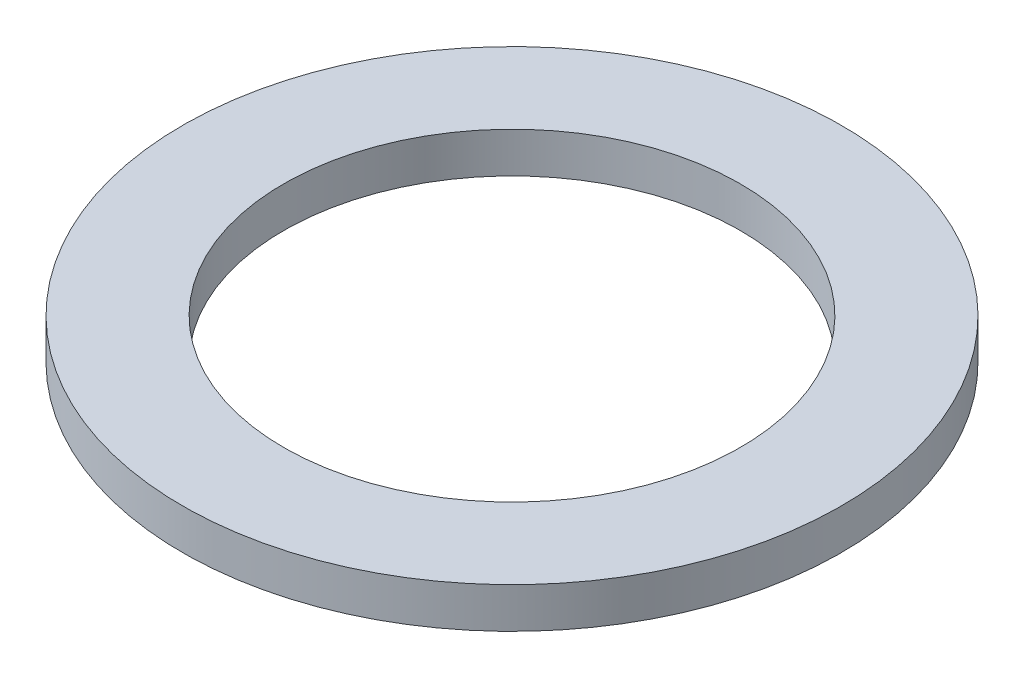
ISO-10303-21;
HEADER;
FILE_DESCRIPTION(('STEP AP214'),'2;1');
FILE_NAME('part.step','',(''),(''),'','','');
FILE_SCHEMA(('AUTOMOTIVE_DESIGN { 1 0 10303 214 1 1 1 1 }'));
ENDSEC;
DATA;
#1=APPLICATION_CONTEXT('core data for automotive mechanical design processes');
#2=APPLICATION_PROTOCOL_DEFINITION('international standard','automotive_design',2000,#1);
#3=PRODUCT_CONTEXT('',#1,'mechanical');
#4=PRODUCT('Part','Part','',(#3));
#5=PRODUCT_RELATED_PRODUCT_CATEGORY('part','',(#4));
#6=PRODUCT_DEFINITION_FORMATION('','',#4);
#7=PRODUCT_DEFINITION_CONTEXT('part definition',#1,'design');
#8=PRODUCT_DEFINITION('design','',#6,#7);
#9=PRODUCT_DEFINITION_SHAPE('','',#8);
#10=(LENGTH_UNIT() NAMED_UNIT(*) SI_UNIT(.MILLI.,.METRE.));
#11=(NAMED_UNIT(*) PLANE_ANGLE_UNIT() SI_UNIT($,.RADIAN.));
#12=(NAMED_UNIT(*) SI_UNIT($,.STERADIAN.) SOLID_ANGLE_UNIT());
#13=UNCERTAINTY_MEASURE_WITH_UNIT(LENGTH_MEASURE(1.E-05),#10,'distance_accuracy_value','');
#14=(GEOMETRIC_REPRESENTATION_CONTEXT(3) GLOBAL_UNCERTAINTY_ASSIGNED_CONTEXT((#13)) GLOBAL_UNIT_ASSIGNED_CONTEXT((#10,
#11,#12)) REPRESENTATION_CONTEXT('',''));
#15=CARTESIAN_POINT('',(0.,0.,0.));
#16=DIRECTION('',(0.,0.,1.));
#17=DIRECTION('',(1.,0.,0.));
#18=AXIS2_PLACEMENT_3D('',#15,#16,#17);
#19=CARTESIAN_POINT('',(-41.1984171468201,297.912651075744,-64.7773377462162));
#20=DIRECTION('',(0.,-1.,0.));
#21=DIRECTION('',(0.307079518587733,0.,-0.951683859936653));
#22=AXIS2_PLACEMENT_3D('',#19,#20,#21);
#23=PLANE('',#22);
#24=CARTESIAN_POINT('',(-41.1984171468201,297.912651075744,-64.7773377462162));
#25=DIRECTION('',(0.,1.,0.));
#26=DIRECTION('',(0.307079518587733,0.,-0.951683859936653));
#27=AXIS2_PLACEMENT_3D('',#24,#25,#26);
#28=CIRCLE('',#27,19.75);
#29=CARTESIAN_POINT('',(-35.1335966547124,297.912651075744,-83.5730939799651));
#30=VERTEX_POINT('',#29);
#31=EDGE_CURVE('E11',#30,#30,#28,.T.);
#32=ORIENTED_EDGE('',*,*,#31,.T.);
#33=EDGE_LOOP('',(#32));
#34=FACE_BOUND('',#33,.T.);
#35=CARTESIAN_POINT('',(-41.1984171468201,297.912651075744,-64.7773377462162));
#36=DIRECTION('',(0.,1.,0.));
#37=DIRECTION('',(0.307079518587733,0.,-0.951683859936653));
#38=AXIS2_PLACEMENT_3D('',#35,#36,#37);
#39=CIRCLE('',#38,28.5);
#40=CARTESIAN_POINT('',(-32.4466508670697,297.912651075744,-91.9003277544108));
#41=VERTEX_POINT('',#40);
#42=EDGE_CURVE('E28',#41,#41,#39,.T.);
#43=ORIENTED_EDGE('',*,*,#42,.F.);
#44=EDGE_LOOP('',(#43));
#45=FACE_BOUND('',#44,.T.);
#46=ADVANCED_FACE('F17',(#34,#45),#23,.T.);
#47=CARTESIAN_POINT('',(-41.1984171468201,301.412651075744,-64.7773377462162));
#48=DIRECTION('',(0.,1.,0.));
#49=DIRECTION('',(-0.307079518587733,0.,0.951683859936653));
#50=AXIS2_PLACEMENT_3D('',#47,#48,#49);
#51=PLANE('',#50);
#52=CARTESIAN_POINT('',(-41.1984171468201,301.412651075744,-64.7773377462162));
#53=DIRECTION('',(0.,1.,0.));
#54=DIRECTION('',(0.307079518587733,0.,-0.951683859936653));
#55=AXIS2_PLACEMENT_3D('',#52,#53,#54);
#56=CIRCLE('',#55,19.75);
#57=CARTESIAN_POINT('',(-35.1335966547124,301.412651075744,-83.5730939799651));
#58=VERTEX_POINT('',#57);
#59=EDGE_CURVE('E40',#58,#58,#56,.T.);
#60=ORIENTED_EDGE('',*,*,#59,.F.);
#61=EDGE_LOOP('',(#60));
#62=FACE_BOUND('',#61,.T.);
#63=CARTESIAN_POINT('',(-41.1984171468201,301.412651075744,-64.7773377462162));
#64=DIRECTION('',(0.,-1.,0.));
#65=DIRECTION('',(-0.307079518587733,0.,0.951683859936653));
#66=AXIS2_PLACEMENT_3D('',#63,#64,#65);
#67=CIRCLE('',#66,28.5);
#68=CARTESIAN_POINT('',(-49.9501834265705,301.412651075744,-37.6543477380216));
#69=VERTEX_POINT('',#68);
#70=EDGE_CURVE('E21',#69,#69,#67,.T.);
#71=ORIENTED_EDGE('',*,*,#70,.F.);
#72=EDGE_LOOP('',(#71));
#73=FACE_BOUND('',#72,.T.);
#74=ADVANCED_FACE('F44',(#62,#73),#51,.T.);
#75=CARTESIAN_POINT('',(-41.1984171468201,301.412651075744,-64.7773377462162));
#76=DIRECTION('',(0.,-1.,0.));
#77=DIRECTION('',(0.307079518587733,0.,-0.951683859936653));
#78=AXIS2_PLACEMENT_3D('',#75,#76,#77);
#79=CYLINDRICAL_SURFACE('',#78,28.5);
#80=ORIENTED_EDGE('',*,*,#42,.T.);
#81=EDGE_LOOP('',(#80));
#82=FACE_BOUND('',#81,.T.);
#83=ORIENTED_EDGE('',*,*,#70,.T.);
#84=EDGE_LOOP('',(#83));
#85=FACE_BOUND('',#84,.T.);
#86=ADVANCED_FACE('F57',(#82,#85),#79,.T.);
#87=CARTESIAN_POINT('',(-41.1984171468201,297.912651075744,-64.7773377462162));
#88=DIRECTION('',(0.,1.,0.));
#89=DIRECTION('',(-0.307079518587733,0.,0.951683859936653));
#90=AXIS2_PLACEMENT_3D('',#87,#88,#89);
#91=CYLINDRICAL_SURFACE('',#90,19.75);
#92=ORIENTED_EDGE('',*,*,#59,.T.);
#93=EDGE_LOOP('',(#92));
#94=FACE_BOUND('',#93,.T.);
#95=ORIENTED_EDGE('',*,*,#31,.F.);
#96=EDGE_LOOP('',(#95));
#97=FACE_BOUND('',#96,.T.);
#98=ADVANCED_FACE('F19',(#94,#97),#91,.F.);
#99=CLOSED_SHELL('',(#46,#74,#86,#98));
#100=MANIFOLD_SOLID_BREP('B1',#99);
#101=ADVANCED_BREP_SHAPE_REPRESENTATION('',(#18,#100),#14);
#102=SHAPE_DEFINITION_REPRESENTATION(#9,#101);
ENDSEC;
END-ISO-10303-21;
